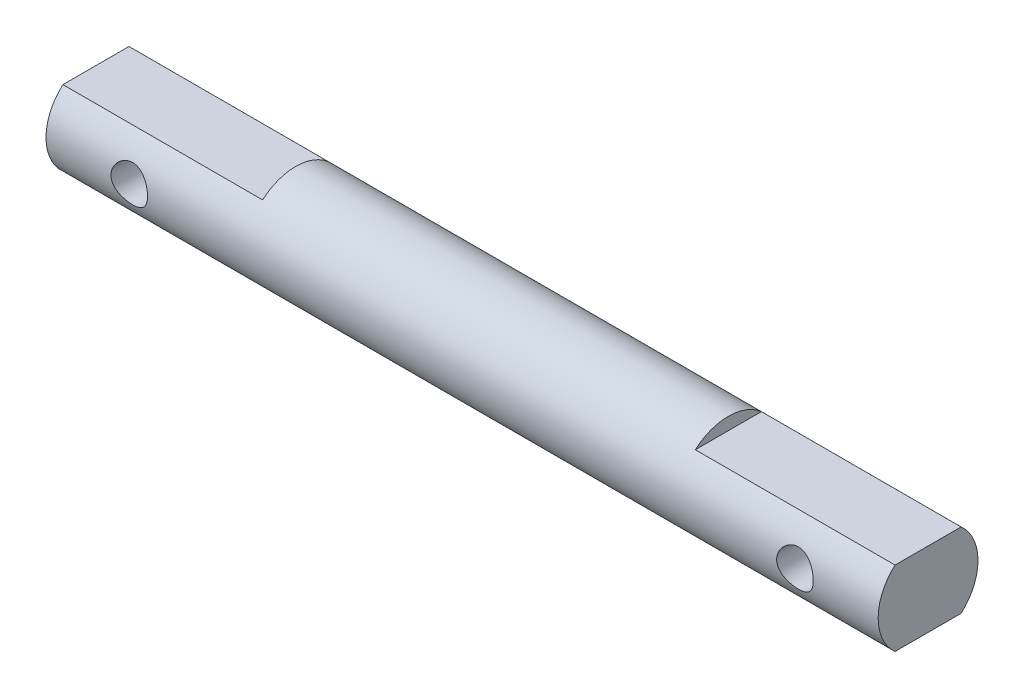
ISO-10303-21;
HEADER;
FILE_DESCRIPTION(('STEP AP214'),'2;1');
FILE_NAME('part.step','',(''),(''),'','','');
FILE_SCHEMA(('AUTOMOTIVE_DESIGN { 1 0 10303 214 1 1 1 1 }'));
ENDSEC;
DATA;
#1=APPLICATION_CONTEXT('core data for automotive mechanical design processes');
#2=APPLICATION_PROTOCOL_DEFINITION('international standard','automotive_design',2000,#1);
#3=PRODUCT_CONTEXT('',#1,'mechanical');
#4=PRODUCT('Part','Part','',(#3));
#5=PRODUCT_RELATED_PRODUCT_CATEGORY('part','',(#4));
#6=PRODUCT_DEFINITION_FORMATION('','',#4);
#7=PRODUCT_DEFINITION_CONTEXT('part definition',#1,'design');
#8=PRODUCT_DEFINITION('design','',#6,#7);
#9=PRODUCT_DEFINITION_SHAPE('','',#8);
#10=(LENGTH_UNIT() NAMED_UNIT(*) SI_UNIT(.MILLI.,.METRE.));
#11=(NAMED_UNIT(*) PLANE_ANGLE_UNIT() SI_UNIT($,.RADIAN.));
#12=(NAMED_UNIT(*) SI_UNIT($,.STERADIAN.) SOLID_ANGLE_UNIT());
#13=UNCERTAINTY_MEASURE_WITH_UNIT(LENGTH_MEASURE(1.E-05),#10,'distance_accuracy_value','');
#14=(GEOMETRIC_REPRESENTATION_CONTEXT(3) GLOBAL_UNCERTAINTY_ASSIGNED_CONTEXT((#13)) GLOBAL_UNIT_ASSIGNED_CONTEXT((#10,
#11,#12)) REPRESENTATION_CONTEXT('',''));
#15=CARTESIAN_POINT('',(0.,0.,0.));
#16=DIRECTION('',(0.,0.,1.));
#17=DIRECTION('',(1.,0.,0.));
#18=AXIS2_PLACEMENT_3D('',#15,#16,#17);
#19=CARTESIAN_POINT('',(-25.,3.,0.));
#20=DIRECTION('',(1.,0.,0.));
#21=DIRECTION('',(0.,0.,-1.));
#22=AXIS2_PLACEMENT_3D('',#19,#20,#21);
#23=PLANE('',#22);
#24=CARTESIAN_POINT('',(-25.,0.,0.));
#25=DIRECTION('',(-1.,0.,0.));
#26=DIRECTION('',(0.,0.,1.));
#27=AXIS2_PLACEMENT_3D('',#24,#25,#26);
#28=CIRCLE('',#27,3.);
#29=CARTESIAN_POINT('',(-25.,2.25,-1.98431348329845));
#30=VERTEX_POINT('',#29);
#31=CARTESIAN_POINT('',(-25.,-2.25,-1.98431348329845));
#32=VERTEX_POINT('',#31);
#33=EDGE_CURVE('E176',#30,#32,#28,.T.);
#34=ORIENTED_EDGE('',*,*,#33,.T.);
#35=DIRECTION('',(0.,0.,1.));
#36=VECTOR('',#35,1.);
#37=CARTESIAN_POINT('',(-25.,-2.25,-3.));
#38=LINE('',#37,#36);
#39=CARTESIAN_POINT('',(-25.,-2.25,1.98431348329845));
#40=VERTEX_POINT('',#39);
#41=EDGE_CURVE('E177',#32,#40,#38,.T.);
#42=ORIENTED_EDGE('',*,*,#41,.T.);
#43=CARTESIAN_POINT('',(-25.,2.25,1.98431348329845));
#44=VERTEX_POINT('',#43);
#45=EDGE_CURVE('E185',#40,#44,#28,.T.);
#46=ORIENTED_EDGE('',*,*,#45,.T.);
#47=DIRECTION('',(0.,0.,1.));
#48=VECTOR('',#47,1.);
#49=CARTESIAN_POINT('',(-25.,2.25,-3.));
#50=LINE('',#49,#48);
#51=EDGE_CURVE('E180',#30,#44,#50,.T.);
#52=ORIENTED_EDGE('',*,*,#51,.F.);
#53=EDGE_LOOP('',(#34,#42,#46,#52));
#54=FACE_BOUND('',#53,.T.);
#55=ADVANCED_FACE('F31',(#54),#23,.F.);
#56=CARTESIAN_POINT('',(25.,3.,0.));
#57=DIRECTION('',(-1.,0.,0.));
#58=DIRECTION('',(0.,0.,1.));
#59=AXIS2_PLACEMENT_3D('',#56,#57,#58);
#60=PLANE('',#59);
#61=CARTESIAN_POINT('',(25.,0.,0.));
#62=DIRECTION('',(-1.,0.,0.));
#63=DIRECTION('',(0.,0.,1.));
#64=AXIS2_PLACEMENT_3D('',#61,#62,#63);
#65=CIRCLE('',#64,3.);
#66=CARTESIAN_POINT('',(25.,-2.25,1.98431348329845));
#67=VERTEX_POINT('',#66);
#68=CARTESIAN_POINT('',(25.,2.25,1.98431348329845));
#69=VERTEX_POINT('',#68);
#70=EDGE_CURVE('E184',#67,#69,#65,.T.);
#71=ORIENTED_EDGE('',*,*,#70,.F.);
#72=DIRECTION('',(0.,0.,1.));
#73=VECTOR('',#72,1.);
#74=CARTESIAN_POINT('',(25.,-2.24999999999999,-3.));
#75=LINE('',#74,#73);
#76=CARTESIAN_POINT('',(25.,-2.24999999999999,-1.98431348329845));
#77=VERTEX_POINT('',#76);
#78=EDGE_CURVE('E49',#77,#67,#75,.T.);
#79=ORIENTED_EDGE('',*,*,#78,.F.);
#80=CARTESIAN_POINT('',(25.,2.25,-1.98431348329845));
#81=VERTEX_POINT('',#80);
#82=EDGE_CURVE('E115',#81,#77,#65,.T.);
#83=ORIENTED_EDGE('',*,*,#82,.F.);
#84=DIRECTION('',(0.,0.,1.));
#85=VECTOR('',#84,1.);
#86=CARTESIAN_POINT('',(25.,2.25,-3.));
#87=LINE('',#86,#85);
#88=EDGE_CURVE('E57',#81,#69,#87,.T.);
#89=ORIENTED_EDGE('',*,*,#88,.T.);
#90=EDGE_LOOP('',(#71,#79,#83,#89));
#91=FACE_BOUND('',#90,.T.);
#92=ADVANCED_FACE('F166',(#91),#60,.F.);
#93=CARTESIAN_POINT('',(0.,0.,0.));
#94=DIRECTION('',(-1.,0.,0.));
#95=DIRECTION('',(0.,0.,1.));
#96=AXIS2_PLACEMENT_3D('',#93,#94,#95);
#97=CYLINDRICAL_SURFACE('',#96,3.);
#98=CARTESIAN_POINT('',(21.1,0.,-3.));
#99=CARTESIAN_POINT('',(21.1000016959377,0.0596653603658475,-3.00000124874777));
#100=CARTESIAN_POINT('',(21.0951301942859,0.119318861047392,-2.99820433362878));
#101=CARTESIAN_POINT('',(21.0758476944229,0.236848244255451,-2.99121508676533));
#102=CARTESIAN_POINT('',(21.0614376008315,0.294724294806991,-2.98602307700504));
#103=CARTESIAN_POINT('',(21.0236525816176,0.406987138550091,-2.97280239953096));
#104=CARTESIAN_POINT('',(21.0002944784406,0.461380257103499,-2.96477905699958));
#105=CARTESIAN_POINT('',(20.9453600789518,0.56547335680578,-2.94669890184719));
#106=CARTESIAN_POINT('',(20.9137816850185,0.615172135653516,-2.93664157034718));
#107=CARTESIAN_POINT('',(20.8419533651427,0.71049716889428,-2.91507648167801));
#108=CARTESIAN_POINT('',(20.8014267972003,0.75590589164363,-2.90352893596448));
#109=CARTESIAN_POINT('',(20.7134398983826,0.839455790057788,-2.88048533673689));
#110=CARTESIAN_POINT('',(20.6659775853424,0.877594880931808,-2.86898929891452));
#111=CARTESIAN_POINT('',(20.563376148578,0.946876023491566,-2.84689276879725));
#112=CARTESIAN_POINT('',(20.5080218172978,0.977715943844814,-2.83633955824423));
#113=CARTESIAN_POINT('',(20.3924637493466,1.02955228614908,-2.81793972857028));
#114=CARTESIAN_POINT('',(20.3322618630331,1.0505524433536,-2.81009208269453));
#115=CARTESIAN_POINT('',(20.2112164474398,1.0812631510737,-2.798415961319));
#116=CARTESIAN_POINT('',(20.1504925023863,1.09138742706648,-2.79444077822037));
#117=CARTESIAN_POINT('',(20.0280875242816,1.10135267987145,-2.7905293041686));
#118=CARTESIAN_POINT('',(19.9664068739079,1.10119766744092,-2.79059143794103));
#119=CARTESIAN_POINT('',(19.8475684309638,1.09092609853663,-2.7946206462547));
#120=CARTESIAN_POINT('',(19.7903527714323,1.08137599754645,-2.79836566494697));
#121=CARTESIAN_POINT('',(19.6784010781988,1.05351920552002,-2.80897082219962));
#122=CARTESIAN_POINT('',(19.6236654025675,1.03521125437041,-2.81583140903281));
#123=CARTESIAN_POINT('',(19.5170456833763,0.990035328733109,-2.8320333504401));
#124=CARTESIAN_POINT('',(19.4652325623985,0.963016175829747,-2.84141799234525));
#125=CARTESIAN_POINT('',(19.3667082597295,0.901290064724288,-2.86159544268106));
#126=CARTESIAN_POINT('',(19.3199987915719,0.866580536276021,-2.87238872140381));
#127=CARTESIAN_POINT('',(19.2298618065168,0.78784062113783,-2.89501075010137));
#128=CARTESIAN_POINT('',(19.1868359200932,0.743355730941567,-2.90686155110834));
#129=CARTESIAN_POINT('',(19.1087384983429,0.647663117597076,-2.92966708861006));
#130=CARTESIAN_POINT('',(19.0736680803958,0.596454451658583,-2.94062169909304));
#131=CARTESIAN_POINT('',(19.0120600315232,0.487779773000808,-2.96060161705553));
#132=CARTESIAN_POINT('',(18.9856506658485,0.430235217521432,-2.96959731294347));
#133=CARTESIAN_POINT('',(18.9430190273705,0.311108672774423,-2.98442731277654));
#134=CARTESIAN_POINT('',(18.9267924370579,0.249528406901531,-2.99026295644358));
#135=CARTESIAN_POINT('',(18.9057463597197,0.127462862761651,-2.99788264484015));
#136=CARTESIAN_POINT('',(18.900385667251,0.0670827891130075,-2.99985872688891));
#137=CARTESIAN_POINT('',(18.8996547992509,-0.0537391869774853,-3.0001264355405));
#138=CARTESIAN_POINT('',(18.9042825233452,-0.114181073749808,-2.99841883675149));
#139=CARTESIAN_POINT('',(18.9229819168092,-0.231108406159618,-2.99163788470485));
#140=CARTESIAN_POINT('',(18.9367037311999,-0.287657784812599,-2.98668929450055));
#141=CARTESIAN_POINT('',(18.9727460210941,-0.397615636671328,-2.97404894323754));
#142=CARTESIAN_POINT('',(18.9950676153823,-0.451023700166589,-2.96635682527047));
#143=CARTESIAN_POINT('',(19.0483784353486,-0.554908427976737,-2.94871738617956));
#144=CARTESIAN_POINT('',(19.0795992520196,-0.605255980194477,-2.93871137811358));
#145=CARTESIAN_POINT('',(19.1495585567129,-0.700162701835578,-2.91755723487566));
#146=CARTESIAN_POINT('',(19.188299730741,-0.744719793590156,-2.90640869230438));
#147=CARTESIAN_POINT('',(19.274729050306,-0.829360890855198,-2.88343377289124));
#148=CARTESIAN_POINT('',(19.322794023905,-0.869060195620299,-2.87160406892303));
#149=CARTESIAN_POINT('',(19.4251419979686,-0.939899669781492,-2.84920568198054));
#150=CARTESIAN_POINT('',(19.4794254299312,-0.971039244708762,-2.83863708661841));
#151=CARTESIAN_POINT('',(19.5930149486137,-1.02386254843665,-2.8200170700311));
#152=CARTESIAN_POINT('',(19.6523338404576,-1.04552125182698,-2.81197232633534));
#153=CARTESIAN_POINT('',(19.7741515392404,-1.07840929932519,-2.79952649364981));
#154=CARTESIAN_POINT('',(19.8366484733941,-1.08964471233036,-2.79512328456104));
#155=CARTESIAN_POINT('',(19.9589005440155,-1.10083806784982,-2.79073255817453));
#156=CARTESIAN_POINT('',(20.0185873167862,-1.1014482886697,-2.79048965654101));
#157=CARTESIAN_POINT('',(20.1371646200869,-1.09303145247646,-2.7937971077441));
#158=CARTESIAN_POINT('',(20.1960552190201,-1.0840052287752,-2.79734713258729));
#159=CARTESIAN_POINT('',(20.3097076343864,-1.05707078841707,-2.80763225279226));
#160=CARTESIAN_POINT('',(20.3645387880301,-1.03941724094369,-2.81427578061567));
#161=CARTESIAN_POINT('',(20.4704956611847,-0.995949426173609,-2.82994981114228));
#162=CARTESIAN_POINT('',(20.5216204604584,-0.970133140652863,-2.83898090407659));
#163=CARTESIAN_POINT('',(20.62153059325,-0.909551414968637,-2.85898260515673));
#164=CARTESIAN_POINT('',(20.6700657713279,-0.874398504847363,-2.87002834990345));
#165=CARTESIAN_POINT('',(20.7607572977932,-0.796752399809455,-2.89254526375225));
#166=CARTESIAN_POINT('',(20.8029116572399,-0.75425692497287,-2.90401656412106));
#167=CARTESIAN_POINT('',(20.8818239918814,-0.660548639786973,-2.92679216754413));
#168=CARTESIAN_POINT('',(20.9181989614741,-0.60900261611206,-2.93805837226636));
#169=CARTESIAN_POINT('',(20.9817509381987,-0.500136860580023,-2.95853467976325));
#170=CARTESIAN_POINT('',(21.00892790779,-0.442817105159341,-2.96774477414609));
#171=CARTESIAN_POINT('',(21.0536679906505,-0.322493606369645,-2.9832468592136));
#172=CARTESIAN_POINT('',(21.0709760902518,-0.259384186418023,-2.9894608548018));
#173=CARTESIAN_POINT('',(21.0941386087502,-0.130844392872352,-2.99783583601898));
#174=CARTESIAN_POINT('',(21.0999981406317,-0.0654150686575991,-2.99999863091548));
#175=CARTESIAN_POINT('',(21.1,0.,-3.));
#176=B_SPLINE_CURVE_WITH_KNOTS('',3,(#98,#99,#100,#101,#102,#103,#104,#105,#106,#107,#108,#109,
#110,#111,#112,#113,#114,#115,#116,#117,#118,#119,#120,#121,#122,#123,#124,#125,#126,#127,#128,
#129,#130,#131,#132,#133,#134,#135,#136,#137,#138,#139,#140,#141,#142,#143,#144,#145,#146,#147,
#148,#149,#150,#151,#152,#153,#154,#155,#156,#157,#158,#159,#160,#161,#162,#163,#164,#165,#166,
#167,#168,#169,#170,#171,#172,#173,#174,#175),.UNSPECIFIED.,.T.,.F.,(4,2,2,2,2,2,2,2,2,2,2,2,2,
2,2,2,2,2,2,2,2,2,2,2,2,2,2,2,2,2,2,2,2,2,2,2,2,2,4),(0.,0.178754907739739,0.357492865169349,
0.535896427659757,0.714345559175,0.899369895863445,1.08444721440599,1.2762026915726,
1.46788531772088,1.65198550181501,1.83601385439912,2.00958682077847,2.18318476902303,
2.35997410918523,2.53682262453215,2.72499447820699,2.91319274508038,3.10406398185192,
3.29485423420864,3.47588192225445,3.65687154732447,3.83127381950643,4.00569878814085,
4.18515848390998,4.36468239466834,4.55415458027959,4.74363992131372,4.93362244947296,
5.12349429191199,5.3016658147168,5.4798219313811,5.65301061537201,5.82624215351945,
6.00825949460879,6.190333455313,6.38165835431487,6.57298403417707,6.76905241099166,
6.96503320271032),.UNSPECIFIED.);
#177=CARTESIAN_POINT('',(21.1,0.,-3.));
#178=VERTEX_POINT('',#177);
#179=EDGE_CURVE('E11',#178,#178,#176,.T.);
#180=ORIENTED_EDGE('',*,*,#179,.T.);
#181=EDGE_LOOP('',(#180));
#182=FACE_BOUND('',#181,.T.);
#183=CARTESIAN_POINT('',(21.1,0.,3.));
#184=CARTESIAN_POINT('',(21.1000016959377,-0.0596653603658475,3.00000124874777));
#185=CARTESIAN_POINT('',(21.0951301942859,-0.119318861047392,2.99820433362878));
#186=CARTESIAN_POINT('',(21.0758476944229,-0.236848244255451,2.99121508676533));
#187=CARTESIAN_POINT('',(21.0614376008315,-0.294724294806991,2.98602307700504));
#188=CARTESIAN_POINT('',(21.0236525816176,-0.406987138550091,2.97280239953096));
#189=CARTESIAN_POINT('',(21.0002944784406,-0.461380257103499,2.96477905699958));
#190=CARTESIAN_POINT('',(20.9453600789518,-0.56547335680578,2.94669890184719));
#191=CARTESIAN_POINT('',(20.9137816850185,-0.615172135653516,2.93664157034718));
#192=CARTESIAN_POINT('',(20.8419533651427,-0.71049716889428,2.91507648167801));
#193=CARTESIAN_POINT('',(20.8014267972003,-0.75590589164363,2.90352893596448));
#194=CARTESIAN_POINT('',(20.7134398983826,-0.839455790057788,2.88048533673689));
#195=CARTESIAN_POINT('',(20.6659775853424,-0.877594880931808,2.86898929891452));
#196=CARTESIAN_POINT('',(20.563376148578,-0.946876023491566,2.84689276879725));
#197=CARTESIAN_POINT('',(20.5080218172978,-0.977715943844814,2.83633955824423));
#198=CARTESIAN_POINT('',(20.3924637493466,-1.02955228614908,2.81793972857028));
#199=CARTESIAN_POINT('',(20.3322618630331,-1.0505524433536,2.81009208269453));
#200=CARTESIAN_POINT('',(20.2112164474398,-1.0812631510737,2.798415961319));
#201=CARTESIAN_POINT('',(20.1504925023863,-1.09138742706648,2.79444077822037));
#202=CARTESIAN_POINT('',(20.0280875242816,-1.10135267987145,2.7905293041686));
#203=CARTESIAN_POINT('',(19.9664068739079,-1.10119766744092,2.79059143794103));
#204=CARTESIAN_POINT('',(19.8475684309638,-1.09092609853663,2.7946206462547));
#205=CARTESIAN_POINT('',(19.7903527714323,-1.08137599754645,2.79836566494697));
#206=CARTESIAN_POINT('',(19.6784010781988,-1.05351920552002,2.80897082219962));
#207=CARTESIAN_POINT('',(19.6236654025675,-1.03521125437041,2.81583140903281));
#208=CARTESIAN_POINT('',(19.5170456833763,-0.990035328733109,2.8320333504401));
#209=CARTESIAN_POINT('',(19.4652325623985,-0.963016175829747,2.84141799234525));
#210=CARTESIAN_POINT('',(19.3667082597295,-0.901290064724288,2.86159544268106));
#211=CARTESIAN_POINT('',(19.3199987915719,-0.866580536276021,2.87238872140381));
#212=CARTESIAN_POINT('',(19.2298618065168,-0.78784062113783,2.89501075010137));
#213=CARTESIAN_POINT('',(19.1868359200932,-0.743355730941567,2.90686155110834));
#214=CARTESIAN_POINT('',(19.1087384983429,-0.647663117597076,2.92966708861006));
#215=CARTESIAN_POINT('',(19.0736680803958,-0.596454451658583,2.94062169909304));
#216=CARTESIAN_POINT('',(19.0120600315232,-0.487779773000808,2.96060161705553));
#217=CARTESIAN_POINT('',(18.9856506658485,-0.430235217521432,2.96959731294347));
#218=CARTESIAN_POINT('',(18.9430190273705,-0.311108672774423,2.98442731277654));
#219=CARTESIAN_POINT('',(18.9267924370579,-0.249528406901531,2.99026295644358));
#220=CARTESIAN_POINT('',(18.9057463597197,-0.127462862761651,2.99788264484015));
#221=CARTESIAN_POINT('',(18.900385667251,-0.0670827891130075,2.99985872688891));
#222=CARTESIAN_POINT('',(18.8996547992509,0.0537391869774853,3.0001264355405));
#223=CARTESIAN_POINT('',(18.9042825233452,0.114181073749808,2.99841883675149));
#224=CARTESIAN_POINT('',(18.9229819168092,0.231108406159618,2.99163788470485));
#225=CARTESIAN_POINT('',(18.9367037311999,0.287657784812599,2.98668929450055));
#226=CARTESIAN_POINT('',(18.9727460210941,0.397615636671328,2.97404894323754));
#227=CARTESIAN_POINT('',(18.9950676153823,0.451023700166589,2.96635682527047));
#228=CARTESIAN_POINT('',(19.0483784353486,0.554908427976737,2.94871738617956));
#229=CARTESIAN_POINT('',(19.0795992520196,0.605255980194477,2.93871137811358));
#230=CARTESIAN_POINT('',(19.1495585567129,0.700162701835578,2.91755723487566));
#231=CARTESIAN_POINT('',(19.188299730741,0.744719793590156,2.90640869230438));
#232=CARTESIAN_POINT('',(19.274729050306,0.829360890855198,2.88343377289124));
#233=CARTESIAN_POINT('',(19.322794023905,0.869060195620299,2.87160406892303));
#234=CARTESIAN_POINT('',(19.4251419979686,0.939899669781492,2.84920568198054));
#235=CARTESIAN_POINT('',(19.4794254299312,0.971039244708762,2.83863708661841));
#236=CARTESIAN_POINT('',(19.5930149486137,1.02386254843665,2.8200170700311));
#237=CARTESIAN_POINT('',(19.6523338404576,1.04552125182698,2.81197232633534));
#238=CARTESIAN_POINT('',(19.7741515392404,1.07840929932519,2.79952649364981));
#239=CARTESIAN_POINT('',(19.8366484733941,1.08964471233036,2.79512328456104));
#240=CARTESIAN_POINT('',(19.9589005440155,1.10083806784982,2.79073255817453));
#241=CARTESIAN_POINT('',(20.0185873167862,1.1014482886697,2.79048965654101));
#242=CARTESIAN_POINT('',(20.1371646200869,1.09303145247646,2.7937971077441));
#243=CARTESIAN_POINT('',(20.1960552190201,1.0840052287752,2.79734713258729));
#244=CARTESIAN_POINT('',(20.3097076343864,1.05707078841707,2.80763225279226));
#245=CARTESIAN_POINT('',(20.3645387880301,1.03941724094369,2.81427578061567));
#246=CARTESIAN_POINT('',(20.4704956611847,0.995949426173609,2.82994981114228));
#247=CARTESIAN_POINT('',(20.5216204604584,0.970133140652863,2.83898090407659));
#248=CARTESIAN_POINT('',(20.62153059325,0.909551414968637,2.85898260515673));
#249=CARTESIAN_POINT('',(20.6700657713279,0.874398504847363,2.87002834990345));
#250=CARTESIAN_POINT('',(20.7607572977932,0.796752399809455,2.89254526375225));
#251=CARTESIAN_POINT('',(20.8029116572399,0.75425692497287,2.90401656412106));
#252=CARTESIAN_POINT('',(20.8818239918814,0.660548639786973,2.92679216754413));
#253=CARTESIAN_POINT('',(20.9181989614741,0.60900261611206,2.93805837226636));
#254=CARTESIAN_POINT('',(20.9817509381987,0.500136860580023,2.95853467976325));
#255=CARTESIAN_POINT('',(21.00892790779,0.442817105159341,2.96774477414609));
#256=CARTESIAN_POINT('',(21.0536679906505,0.322493606369645,2.9832468592136));
#257=CARTESIAN_POINT('',(21.0709760902518,0.259384186418023,2.9894608548018));
#258=CARTESIAN_POINT('',(21.0941386087502,0.130844392872352,2.99783583601898));
#259=CARTESIAN_POINT('',(21.0999981406317,0.0654150686575991,2.99999863091548));
#260=CARTESIAN_POINT('',(21.1,0.,3.));
#261=B_SPLINE_CURVE_WITH_KNOTS('',3,(#183,#184,#185,#186,#187,#188,#189,#190,#191,#192,#193,
#194,#195,#196,#197,#198,#199,#200,#201,#202,#203,#204,#205,#206,#207,#208,#209,#210,#211,#212,
#213,#214,#215,#216,#217,#218,#219,#220,#221,#222,#223,#224,#225,#226,#227,#228,#229,#230,#231,
#232,#233,#234,#235,#236,#237,#238,#239,#240,#241,#242,#243,#244,#245,#246,#247,#248,#249,#250,
#251,#252,#253,#254,#255,#256,#257,#258,#259,#260),.UNSPECIFIED.,.T.,.F.,(4,2,2,2,2,2,2,2,2,2,2,
2,2,2,2,2,2,2,2,2,2,2,2,2,2,2,2,2,2,2,2,2,2,2,2,2,2,2,4),(0.,0.178754907739739,
0.357492865169349,0.535896427659757,0.714345559175,0.899369895863445,1.08444721440599,
1.2762026915726,1.46788531772088,1.65198550181501,1.83601385439912,2.00958682077847,
2.18318476902303,2.35997410918523,2.53682262453215,2.72499447820699,2.91319274508038,
3.10406398185192,3.29485423420864,3.47588192225445,3.65687154732447,3.83127381950643,
4.00569878814085,4.18515848390998,4.36468239466834,4.55415458027959,4.74363992131372,
4.93362244947296,5.12349429191199,5.3016658147168,5.4798219313811,5.65301061537201,
5.82624215351945,6.00825949460879,6.190333455313,6.38165835431487,6.57298403417707,
6.76905241099166,6.96503320271032),.UNSPECIFIED.);
#262=CARTESIAN_POINT('',(21.1,0.,3.));
#263=VERTEX_POINT('',#262);
#264=EDGE_CURVE('E42',#263,#263,#261,.T.);
#265=ORIENTED_EDGE('',*,*,#264,.T.);
#266=EDGE_LOOP('',(#265));
#267=FACE_BOUND('',#266,.T.);
#268=CARTESIAN_POINT('',(-18.9,0.,-3.));
#269=CARTESIAN_POINT('',(-18.8999983040623,0.0596653603658475,-3.00000124874777));
#270=CARTESIAN_POINT('',(-18.9048698057141,0.119318861047392,-2.99820433362878));
#271=CARTESIAN_POINT('',(-18.9241523055771,0.236848244255451,-2.99121508676533));
#272=CARTESIAN_POINT('',(-18.9385623991685,0.294724294806991,-2.98602307700504));
#273=CARTESIAN_POINT('',(-18.9763474183824,0.40698713855009,-2.97280239953096));
#274=CARTESIAN_POINT('',(-18.9997055215594,0.461380257103498,-2.96477905699958));
#275=CARTESIAN_POINT('',(-19.0546399210482,0.56547335680578,-2.94669890184719));
#276=CARTESIAN_POINT('',(-19.0862183149815,0.615172135653516,-2.93664157034718));
#277=CARTESIAN_POINT('',(-19.1580466348573,0.71049716889428,-2.91507648167801));
#278=CARTESIAN_POINT('',(-19.1985732027997,0.755905891643629,-2.90352893596448));
#279=CARTESIAN_POINT('',(-19.2865601016174,0.839455790057788,-2.88048533673689));
#280=CARTESIAN_POINT('',(-19.3340224146576,0.877594880931808,-2.86898929891452));
#281=CARTESIAN_POINT('',(-19.436623851422,0.946876023491566,-2.84689276879725));
#282=CARTESIAN_POINT('',(-19.4919781827022,0.977715943844814,-2.83633955824423));
#283=CARTESIAN_POINT('',(-19.6075362506534,1.02955228614908,-2.81793972857028));
#284=CARTESIAN_POINT('',(-19.6677381369669,1.0505524433536,-2.81009208269453));
#285=CARTESIAN_POINT('',(-19.7887835525602,1.0812631510737,-2.798415961319));
#286=CARTESIAN_POINT('',(-19.8495074976137,1.09138742706648,-2.79444077822037));
#287=CARTESIAN_POINT('',(-19.9719124757184,1.10135267987145,-2.7905293041686));
#288=CARTESIAN_POINT('',(-20.0335931260921,1.10119766744092,-2.79059143794103));
#289=CARTESIAN_POINT('',(-20.1524315690362,1.09092609853663,-2.7946206462547));
#290=CARTESIAN_POINT('',(-20.2096472285677,1.08137599754645,-2.79836566494697));
#291=CARTESIAN_POINT('',(-20.3215989218012,1.05351920552002,-2.80897082219962));
#292=CARTESIAN_POINT('',(-20.3763345974325,1.03521125437041,-2.81583140903281));
#293=CARTESIAN_POINT('',(-20.4829543166237,0.990035328733109,-2.8320333504401));
#294=CARTESIAN_POINT('',(-20.5347674376015,0.963016175829747,-2.84141799234525));
#295=CARTESIAN_POINT('',(-20.6332917402705,0.901290064724288,-2.86159544268106));
#296=CARTESIAN_POINT('',(-20.6800012084281,0.866580536276021,-2.87238872140381));
#297=CARTESIAN_POINT('',(-20.7701381934832,0.78784062113783,-2.89501075010137));
#298=CARTESIAN_POINT('',(-20.8131640799068,0.743355730941567,-2.90686155110834));
#299=CARTESIAN_POINT('',(-20.8912615016571,0.647663117597076,-2.92966708861006));
#300=CARTESIAN_POINT('',(-20.9263319196042,0.596454451658583,-2.94062169909304));
#301=CARTESIAN_POINT('',(-20.9879399684768,0.487779773000808,-2.96060161705553));
#302=CARTESIAN_POINT('',(-21.0143493341515,0.430235217521432,-2.96959731294347));
#303=CARTESIAN_POINT('',(-21.0569809726295,0.311108672774423,-2.98442731277654));
#304=CARTESIAN_POINT('',(-21.0732075629421,0.249528406901531,-2.99026295644358));
#305=CARTESIAN_POINT('',(-21.0942536402803,0.127462862761651,-2.99788264484015));
#306=CARTESIAN_POINT('',(-21.099614332749,0.0670827891130075,-2.99985872688891));
#307=CARTESIAN_POINT('',(-21.1003452007491,-0.0537391869774853,-3.0001264355405));
#308=CARTESIAN_POINT('',(-21.0957174766548,-0.114181073749808,-2.99841883675149));
#309=CARTESIAN_POINT('',(-21.0770180831908,-0.231108406159618,-2.99163788470485));
#310=CARTESIAN_POINT('',(-21.0632962688001,-0.287657784812599,-2.98668929450055));
#311=CARTESIAN_POINT('',(-21.0272539789059,-0.397615636671328,-2.97404894323754));
#312=CARTESIAN_POINT('',(-21.0049323846177,-0.451023700166589,-2.96635682527047));
#313=CARTESIAN_POINT('',(-20.9516215646514,-0.554908427976737,-2.94871738617956));
#314=CARTESIAN_POINT('',(-20.9204007479804,-0.605255980194477,-2.93871137811358));
#315=CARTESIAN_POINT('',(-20.8504414432871,-0.700162701835578,-2.91755723487566));
#316=CARTESIAN_POINT('',(-20.811700269259,-0.744719793590156,-2.90640869230438));
#317=CARTESIAN_POINT('',(-20.725270949694,-0.829360890855198,-2.88343377289124));
#318=CARTESIAN_POINT('',(-20.677205976095,-0.869060195620299,-2.87160406892303));
#319=CARTESIAN_POINT('',(-20.5748580020314,-0.939899669781492,-2.84920568198054));
#320=CARTESIAN_POINT('',(-20.5205745700688,-0.971039244708762,-2.83863708661841));
#321=CARTESIAN_POINT('',(-20.4069850513863,-1.02386254843665,-2.8200170700311));
#322=CARTESIAN_POINT('',(-20.3476661595424,-1.04552125182698,-2.81197232633534));
#323=CARTESIAN_POINT('',(-20.2258484607596,-1.0784092993252,-2.79952649364981));
#324=CARTESIAN_POINT('',(-20.1633515266059,-1.08964471233036,-2.79512328456104));
#325=CARTESIAN_POINT('',(-20.0410994559845,-1.10083806784982,-2.79073255817453));
#326=CARTESIAN_POINT('',(-19.9814126832138,-1.1014482886697,-2.79048965654101));
#327=CARTESIAN_POINT('',(-19.8628353799131,-1.09303145247646,-2.7937971077441));
#328=CARTESIAN_POINT('',(-19.8039447809799,-1.0840052287752,-2.79734713258729));
#329=CARTESIAN_POINT('',(-19.6902923656136,-1.05707078841707,-2.80763225279226));
#330=CARTESIAN_POINT('',(-19.6354612119699,-1.03941724094369,-2.81427578061567));
#331=CARTESIAN_POINT('',(-19.5295043388153,-0.995949426173609,-2.82994981114228));
#332=CARTESIAN_POINT('',(-19.4783795395416,-0.970133140652863,-2.83898090407659));
#333=CARTESIAN_POINT('',(-19.37846940675,-0.909551414968637,-2.85898260515673));
#334=CARTESIAN_POINT('',(-19.3299342286721,-0.874398504847363,-2.87002834990345));
#335=CARTESIAN_POINT('',(-19.2392427022068,-0.796752399809455,-2.89254526375225));
#336=CARTESIAN_POINT('',(-19.1970883427601,-0.75425692497287,-2.90401656412106));
#337=CARTESIAN_POINT('',(-19.1181760081186,-0.660548639786973,-2.92679216754413));
#338=CARTESIAN_POINT('',(-19.0818010385259,-0.60900261611206,-2.93805837226636));
#339=CARTESIAN_POINT('',(-19.0182490618013,-0.500136860580023,-2.95853467976325));
#340=CARTESIAN_POINT('',(-18.99107209221,-0.442817105159341,-2.96774477414609));
#341=CARTESIAN_POINT('',(-18.9463320093495,-0.322493606369645,-2.9832468592136));
#342=CARTESIAN_POINT('',(-18.9290239097482,-0.259384186418022,-2.9894608548018));
#343=CARTESIAN_POINT('',(-18.9058613912498,-0.130844392872352,-2.99783583601898));
#344=CARTESIAN_POINT('',(-18.9000018593683,-0.0654150686575989,-2.99999863091548));
#345=CARTESIAN_POINT('',(-18.9,0.,-3.));
#346=B_SPLINE_CURVE_WITH_KNOTS('',3,(#268,#269,#270,#271,#272,#273,#274,#275,#276,#277,#278,
#279,#280,#281,#282,#283,#284,#285,#286,#287,#288,#289,#290,#291,#292,#293,#294,#295,#296,#297,
#298,#299,#300,#301,#302,#303,#304,#305,#306,#307,#308,#309,#310,#311,#312,#313,#314,#315,#316,
#317,#318,#319,#320,#321,#322,#323,#324,#325,#326,#327,#328,#329,#330,#331,#332,#333,#334,#335,
#336,#337,#338,#339,#340,#341,#342,#343,#344,#345),.UNSPECIFIED.,.T.,.F.,(4,2,2,2,2,2,2,2,2,2,2,
2,2,2,2,2,2,2,2,2,2,2,2,2,2,2,2,2,2,2,2,2,2,2,2,2,2,2,4),(0.,0.178754907739739,
0.357492865169349,0.535896427659754,0.714345559175,0.899369895863445,1.08444721440599,
1.2762026915726,1.46788531772088,1.65198550181501,1.83601385439912,2.00958682077848,
2.18318476902303,2.35997410918523,2.53682262453215,2.72499447820699,2.91319274508038,
3.10406398185192,3.29485423420864,3.47588192225445,3.65687154732447,3.83127381950643,
4.00569878814085,4.18515848390998,4.36468239466834,4.55415458027959,4.74363992131372,
4.93362244947296,5.12349429191199,5.3016658147168,5.4798219313811,5.65301061537201,
5.82624215351945,6.00825949460879,6.190333455313,6.38165835431487,6.57298403417707,
6.76905241099166,6.96503320271032),.UNSPECIFIED.);
#347=CARTESIAN_POINT('',(-18.9,0.,-3.));
#348=VERTEX_POINT('',#347);
#349=EDGE_CURVE('E119',#348,#348,#346,.T.);
#350=ORIENTED_EDGE('',*,*,#349,.T.);
#351=EDGE_LOOP('',(#350));
#352=FACE_BOUND('',#351,.T.);
#353=CARTESIAN_POINT('',(-18.9,0.,3.));
#354=CARTESIAN_POINT('',(-18.8999983040623,-0.0596653603658475,3.00000124874777));
#355=CARTESIAN_POINT('',(-18.9048698057141,-0.119318861047392,2.99820433362878));
#356=CARTESIAN_POINT('',(-18.9241523055771,-0.236848244255451,2.99121508676533));
#357=CARTESIAN_POINT('',(-18.9385623991685,-0.294724294806991,2.98602307700504));
#358=CARTESIAN_POINT('',(-18.9763474183824,-0.40698713855009,2.97280239953096));
#359=CARTESIAN_POINT('',(-18.9997055215594,-0.461380257103498,2.96477905699958));
#360=CARTESIAN_POINT('',(-19.0546399210482,-0.56547335680578,2.94669890184719));
#361=CARTESIAN_POINT('',(-19.0862183149815,-0.615172135653516,2.93664157034718));
#362=CARTESIAN_POINT('',(-19.1580466348573,-0.71049716889428,2.91507648167801));
#363=CARTESIAN_POINT('',(-19.1985732027997,-0.755905891643629,2.90352893596448));
#364=CARTESIAN_POINT('',(-19.2865601016174,-0.839455790057788,2.88048533673689));
#365=CARTESIAN_POINT('',(-19.3340224146576,-0.877594880931808,2.86898929891452));
#366=CARTESIAN_POINT('',(-19.436623851422,-0.946876023491566,2.84689276879725));
#367=CARTESIAN_POINT('',(-19.4919781827022,-0.977715943844814,2.83633955824423));
#368=CARTESIAN_POINT('',(-19.6075362506534,-1.02955228614908,2.81793972857028));
#369=CARTESIAN_POINT('',(-19.6677381369669,-1.0505524433536,2.81009208269453));
#370=CARTESIAN_POINT('',(-19.7887835525602,-1.0812631510737,2.798415961319));
#371=CARTESIAN_POINT('',(-19.8495074976137,-1.09138742706648,2.79444077822037));
#372=CARTESIAN_POINT('',(-19.9719124757184,-1.10135267987145,2.7905293041686));
#373=CARTESIAN_POINT('',(-20.0335931260921,-1.10119766744092,2.79059143794103));
#374=CARTESIAN_POINT('',(-20.1524315690362,-1.09092609853663,2.7946206462547));
#375=CARTESIAN_POINT('',(-20.2096472285677,-1.08137599754645,2.79836566494697));
#376=CARTESIAN_POINT('',(-20.3215989218012,-1.05351920552002,2.80897082219962));
#377=CARTESIAN_POINT('',(-20.3763345974325,-1.03521125437041,2.81583140903281));
#378=CARTESIAN_POINT('',(-20.4829543166237,-0.990035328733109,2.8320333504401));
#379=CARTESIAN_POINT('',(-20.5347674376015,-0.963016175829747,2.84141799234525));
#380=CARTESIAN_POINT('',(-20.6332917402705,-0.901290064724288,2.86159544268106));
#381=CARTESIAN_POINT('',(-20.6800012084281,-0.866580536276021,2.87238872140381));
#382=CARTESIAN_POINT('',(-20.7701381934832,-0.78784062113783,2.89501075010137));
#383=CARTESIAN_POINT('',(-20.8131640799068,-0.743355730941567,2.90686155110834));
#384=CARTESIAN_POINT('',(-20.8912615016571,-0.647663117597076,2.92966708861006));
#385=CARTESIAN_POINT('',(-20.9263319196042,-0.596454451658583,2.94062169909304));
#386=CARTESIAN_POINT('',(-20.9879399684768,-0.487779773000808,2.96060161705553));
#387=CARTESIAN_POINT('',(-21.0143493341515,-0.430235217521432,2.96959731294347));
#388=CARTESIAN_POINT('',(-21.0569809726295,-0.311108672774423,2.98442731277654));
#389=CARTESIAN_POINT('',(-21.0732075629421,-0.249528406901531,2.99026295644358));
#390=CARTESIAN_POINT('',(-21.0942536402803,-0.127462862761651,2.99788264484015));
#391=CARTESIAN_POINT('',(-21.099614332749,-0.0670827891130075,2.99985872688891));
#392=CARTESIAN_POINT('',(-21.1003452007491,0.0537391869774853,3.0001264355405));
#393=CARTESIAN_POINT('',(-21.0957174766548,0.114181073749808,2.99841883675149));
#394=CARTESIAN_POINT('',(-21.0770180831908,0.231108406159618,2.99163788470485));
#395=CARTESIAN_POINT('',(-21.0632962688001,0.287657784812599,2.98668929450055));
#396=CARTESIAN_POINT('',(-21.0272539789059,0.397615636671328,2.97404894323754));
#397=CARTESIAN_POINT('',(-21.0049323846177,0.451023700166589,2.96635682527047));
#398=CARTESIAN_POINT('',(-20.9516215646514,0.554908427976737,2.94871738617956));
#399=CARTESIAN_POINT('',(-20.9204007479804,0.605255980194477,2.93871137811358));
#400=CARTESIAN_POINT('',(-20.8504414432871,0.700162701835578,2.91755723487566));
#401=CARTESIAN_POINT('',(-20.811700269259,0.744719793590156,2.90640869230438));
#402=CARTESIAN_POINT('',(-20.725270949694,0.829360890855198,2.88343377289124));
#403=CARTESIAN_POINT('',(-20.677205976095,0.869060195620299,2.87160406892303));
#404=CARTESIAN_POINT('',(-20.5748580020314,0.939899669781492,2.84920568198054));
#405=CARTESIAN_POINT('',(-20.5205745700688,0.971039244708762,2.83863708661841));
#406=CARTESIAN_POINT('',(-20.4069850513863,1.02386254843665,2.8200170700311));
#407=CARTESIAN_POINT('',(-20.3476661595424,1.04552125182698,2.81197232633534));
#408=CARTESIAN_POINT('',(-20.2258484607596,1.0784092993252,2.79952649364981));
#409=CARTESIAN_POINT('',(-20.1633515266059,1.08964471233036,2.79512328456104));
#410=CARTESIAN_POINT('',(-20.0410994559845,1.10083806784982,2.79073255817453));
#411=CARTESIAN_POINT('',(-19.9814126832138,1.1014482886697,2.79048965654101));
#412=CARTESIAN_POINT('',(-19.8628353799131,1.09303145247646,2.7937971077441));
#413=CARTESIAN_POINT('',(-19.8039447809799,1.0840052287752,2.79734713258729));
#414=CARTESIAN_POINT('',(-19.6902923656136,1.05707078841707,2.80763225279226));
#415=CARTESIAN_POINT('',(-19.6354612119699,1.03941724094369,2.81427578061567));
#416=CARTESIAN_POINT('',(-19.5295043388153,0.995949426173609,2.82994981114228));
#417=CARTESIAN_POINT('',(-19.4783795395416,0.970133140652863,2.83898090407659));
#418=CARTESIAN_POINT('',(-19.37846940675,0.909551414968637,2.85898260515673));
#419=CARTESIAN_POINT('',(-19.3299342286721,0.874398504847363,2.87002834990345));
#420=CARTESIAN_POINT('',(-19.2392427022068,0.796752399809455,2.89254526375225));
#421=CARTESIAN_POINT('',(-19.1970883427601,0.75425692497287,2.90401656412106));
#422=CARTESIAN_POINT('',(-19.1181760081186,0.660548639786973,2.92679216754413));
#423=CARTESIAN_POINT('',(-19.0818010385259,0.60900261611206,2.93805837226636));
#424=CARTESIAN_POINT('',(-19.0182490618013,0.500136860580023,2.95853467976325));
#425=CARTESIAN_POINT('',(-18.99107209221,0.442817105159341,2.96774477414609));
#426=CARTESIAN_POINT('',(-18.9463320093495,0.322493606369645,2.9832468592136));
#427=CARTESIAN_POINT('',(-18.9290239097482,0.259384186418022,2.9894608548018));
#428=CARTESIAN_POINT('',(-18.9058613912498,0.130844392872352,2.99783583601898));
#429=CARTESIAN_POINT('',(-18.9000018593683,0.0654150686575989,2.99999863091548));
#430=CARTESIAN_POINT('',(-18.9,0.,3.));
#431=B_SPLINE_CURVE_WITH_KNOTS('',3,(#353,#354,#355,#356,#357,#358,#359,#360,#361,#362,#363,
#364,#365,#366,#367,#368,#369,#370,#371,#372,#373,#374,#375,#376,#377,#378,#379,#380,#381,#382,
#383,#384,#385,#386,#387,#388,#389,#390,#391,#392,#393,#394,#395,#396,#397,#398,#399,#400,#401,
#402,#403,#404,#405,#406,#407,#408,#409,#410,#411,#412,#413,#414,#415,#416,#417,#418,#419,#420,
#421,#422,#423,#424,#425,#426,#427,#428,#429,#430),.UNSPECIFIED.,.T.,.F.,(4,2,2,2,2,2,2,2,2,2,2,
2,2,2,2,2,2,2,2,2,2,2,2,2,2,2,2,2,2,2,2,2,2,2,2,2,2,2,4),(0.,0.178754907739739,
0.357492865169349,0.535896427659754,0.714345559175,0.899369895863445,1.08444721440599,
1.2762026915726,1.46788531772088,1.65198550181501,1.83601385439912,2.00958682077848,
2.18318476902303,2.35997410918523,2.53682262453215,2.72499447820699,2.91319274508038,
3.10406398185192,3.29485423420864,3.47588192225445,3.65687154732447,3.83127381950643,
4.00569878814085,4.18515848390998,4.36468239466834,4.55415458027959,4.74363992131372,
4.93362244947296,5.12349429191199,5.3016658147168,5.4798219313811,5.65301061537201,
5.82624215351945,6.00825949460879,6.190333455313,6.38165835431487,6.57298403417707,
6.76905241099166,6.96503320271032),.UNSPECIFIED.);
#432=CARTESIAN_POINT('',(-18.9,0.,3.));
#433=VERTEX_POINT('',#432);
#434=EDGE_CURVE('E116',#433,#433,#431,.T.);
#435=ORIENTED_EDGE('',*,*,#434,.T.);
#436=EDGE_LOOP('',(#435));
#437=FACE_BOUND('',#436,.T.);
#438=ORIENTED_EDGE('',*,*,#45,.F.);
#439=DIRECTION('',(-1.,0.,0.));
#440=VECTOR('',#439,1.);
#441=CARTESIAN_POINT('',(0.,-2.25,1.98431348329845));
#442=LINE('',#441,#440);
#443=CARTESIAN_POINT('',(-13.,-2.25,1.98431348329844));
#444=VERTEX_POINT('',#443);
#445=EDGE_CURVE('E204',#40,#444,#442,.F.);
#446=ORIENTED_EDGE('',*,*,#445,.T.);
#447=CARTESIAN_POINT('',(-13.,0.,0.));
#448=DIRECTION('',(1.,0.,0.));
#449=DIRECTION('',(0.,0.,-1.));
#450=AXIS2_PLACEMENT_3D('',#447,#448,#449);
#451=CIRCLE('',#450,3.);
#452=CARTESIAN_POINT('',(-13.,-2.25,-1.98431348329844));
#453=VERTEX_POINT('',#452);
#454=EDGE_CURVE('E199',#444,#453,#451,.T.);
#455=ORIENTED_EDGE('',*,*,#454,.T.);
#456=DIRECTION('',(-1.,0.,0.));
#457=VECTOR('',#456,1.);
#458=CARTESIAN_POINT('',(0.,-2.25,-1.98431348329845));
#459=LINE('',#458,#457);
#460=EDGE_CURVE('E202',#453,#32,#459,.T.);
#461=ORIENTED_EDGE('',*,*,#460,.T.);
#462=ORIENTED_EDGE('',*,*,#33,.F.);
#463=DIRECTION('',(-1.,0.,0.));
#464=VECTOR('',#463,1.);
#465=CARTESIAN_POINT('',(0.,2.25,-1.98431348329845));
#466=LINE('',#465,#464);
#467=CARTESIAN_POINT('',(-13.,2.25,-1.98431348329845));
#468=VERTEX_POINT('',#467);
#469=EDGE_CURVE('E192',#30,#468,#466,.F.);
#470=ORIENTED_EDGE('',*,*,#469,.T.);
#471=CARTESIAN_POINT('',(-13.,0.,0.));
#472=DIRECTION('',(1.,0.,0.));
#473=DIRECTION('',(0.,0.,-1.));
#474=AXIS2_PLACEMENT_3D('',#471,#472,#473);
#475=CIRCLE('',#474,3.);
#476=CARTESIAN_POINT('',(-13.,2.25,1.98431348329845));
#477=VERTEX_POINT('',#476);
#478=EDGE_CURVE('E194',#468,#477,#475,.T.);
#479=ORIENTED_EDGE('',*,*,#478,.T.);
#480=DIRECTION('',(-1.,0.,0.));
#481=VECTOR('',#480,1.);
#482=CARTESIAN_POINT('',(0.,2.25,1.98431348329845));
#483=LINE('',#482,#481);
#484=EDGE_CURVE('E196',#477,#44,#483,.T.);
#485=ORIENTED_EDGE('',*,*,#484,.T.);
#486=EDGE_LOOP('',(#438,#446,#455,#461,#462,#470,#479,#485));
#487=FACE_BOUND('',#486,.T.);
#488=ORIENTED_EDGE('',*,*,#82,.T.);
#489=DIRECTION('',(-1.,0.,0.));
#490=VECTOR('',#489,1.);
#491=CARTESIAN_POINT('',(0.,-2.25,-1.98431348329845));
#492=LINE('',#491,#490);
#493=CARTESIAN_POINT('',(13.,-2.24999999999999,-1.98431348329845));
#494=VERTEX_POINT('',#493);
#495=EDGE_CURVE('E106',#77,#494,#492,.T.);
#496=ORIENTED_EDGE('',*,*,#495,.T.);
#497=CARTESIAN_POINT('',(13.,0.,0.));
#498=DIRECTION('',(-1.,0.,0.));
#499=DIRECTION('',(0.,0.,1.));
#500=AXIS2_PLACEMENT_3D('',#497,#498,#499);
#501=CIRCLE('',#500,3.);
#502=CARTESIAN_POINT('',(13.,-2.24999999999999,1.98431348329845));
#503=VERTEX_POINT('',#502);
#504=EDGE_CURVE('E100',#494,#503,#501,.T.);
#505=ORIENTED_EDGE('',*,*,#504,.T.);
#506=DIRECTION('',(-1.,0.,0.));
#507=VECTOR('',#506,1.);
#508=CARTESIAN_POINT('',(0.,-2.25,1.98431348329845));
#509=LINE('',#508,#507);
#510=EDGE_CURVE('E107',#503,#67,#509,.F.);
#511=ORIENTED_EDGE('',*,*,#510,.T.);
#512=ORIENTED_EDGE('',*,*,#70,.T.);
#513=DIRECTION('',(-1.,0.,0.));
#514=VECTOR('',#513,1.);
#515=CARTESIAN_POINT('',(0.,2.25,1.98431348329845));
#516=LINE('',#515,#514);
#517=CARTESIAN_POINT('',(13.,2.25,1.98431348329845));
#518=VERTEX_POINT('',#517);
#519=EDGE_CURVE('E212',#69,#518,#516,.T.);
#520=ORIENTED_EDGE('',*,*,#519,.T.);
#521=CARTESIAN_POINT('',(13.,0.,0.));
#522=DIRECTION('',(-1.,0.,0.));
#523=DIRECTION('',(0.,0.,1.));
#524=AXIS2_PLACEMENT_3D('',#521,#522,#523);
#525=CIRCLE('',#524,3.);
#526=CARTESIAN_POINT('',(13.,2.25,-1.98431348329845));
#527=VERTEX_POINT('',#526);
#528=EDGE_CURVE('E209',#518,#527,#525,.T.);
#529=ORIENTED_EDGE('',*,*,#528,.T.);
#530=DIRECTION('',(-1.,0.,0.));
#531=VECTOR('',#530,1.);
#532=CARTESIAN_POINT('',(0.,2.25,-1.98431348329845));
#533=LINE('',#532,#531);
#534=EDGE_CURVE('E207',#527,#81,#533,.F.);
#535=ORIENTED_EDGE('',*,*,#534,.T.);
#536=EDGE_LOOP('',(#488,#496,#505,#511,#512,#520,#529,#535));
#537=FACE_BOUND('',#536,.T.);
#538=ADVANCED_FACE('F113',(#182,#267,#352,#437,#487,#537),#97,.T.);
#539=CARTESIAN_POINT('',(-13.,3.,-3.));
#540=DIRECTION('',(1.,0.,0.));
#541=DIRECTION('',(0.,0.,-1.));
#542=AXIS2_PLACEMENT_3D('',#539,#540,#541);
#543=PLANE('',#542);
#544=DIRECTION('',(0.,0.,1.));
#545=VECTOR('',#544,1.);
#546=CARTESIAN_POINT('',(-13.,2.25,-3.));
#547=LINE('',#546,#545);
#548=EDGE_CURVE('E188',#468,#477,#547,.T.);
#549=ORIENTED_EDGE('',*,*,#548,.T.);
#550=ORIENTED_EDGE('',*,*,#478,.F.);
#551=EDGE_LOOP('',(#549,#550));
#552=FACE_BOUND('',#551,.T.);
#553=ADVANCED_FACE('F158',(#552),#543,.F.);
#554=CARTESIAN_POINT('',(-25.,2.25,-3.));
#555=DIRECTION('',(0.,-1.,0.));
#556=DIRECTION('',(1.,0.,0.));
#557=AXIS2_PLACEMENT_3D('',#554,#555,#556);
#558=PLANE('',#557);
#559=ORIENTED_EDGE('',*,*,#548,.F.);
#560=ORIENTED_EDGE('',*,*,#469,.F.);
#561=ORIENTED_EDGE('',*,*,#51,.T.);
#562=ORIENTED_EDGE('',*,*,#484,.F.);
#563=EDGE_LOOP('',(#559,#560,#561,#562));
#564=FACE_BOUND('',#563,.T.);
#565=ADVANCED_FACE('F153',(#564),#558,.F.);
#566=CARTESIAN_POINT('',(-25.,-2.25,-3.));
#567=DIRECTION('',(0.,1.,0.));
#568=DIRECTION('',(-1.,0.,0.));
#569=AXIS2_PLACEMENT_3D('',#566,#567,#568);
#570=PLANE('',#569);
#571=DIRECTION('',(0.,0.,1.));
#572=VECTOR('',#571,1.);
#573=CARTESIAN_POINT('',(-13.,-2.25,-3.));
#574=LINE('',#573,#572);
#575=EDGE_CURVE('E215',#453,#444,#574,.T.);
#576=ORIENTED_EDGE('',*,*,#575,.T.);
#577=ORIENTED_EDGE('',*,*,#445,.F.);
#578=ORIENTED_EDGE('',*,*,#41,.F.);
#579=ORIENTED_EDGE('',*,*,#460,.F.);
#580=EDGE_LOOP('',(#576,#577,#578,#579));
#581=FACE_BOUND('',#580,.T.);
#582=ADVANCED_FACE('F150',(#581),#570,.F.);
#583=CARTESIAN_POINT('',(-13.,-2.25,-3.));
#584=DIRECTION('',(1.,0.,0.));
#585=DIRECTION('',(0.,0.,-1.));
#586=AXIS2_PLACEMENT_3D('',#583,#584,#585);
#587=PLANE('',#586);
#588=ORIENTED_EDGE('',*,*,#575,.F.);
#589=ORIENTED_EDGE('',*,*,#454,.F.);
#590=EDGE_LOOP('',(#588,#589));
#591=FACE_BOUND('',#590,.T.);
#592=ADVANCED_FACE('F148',(#591),#587,.F.);
#593=CARTESIAN_POINT('',(13.,3.,-3.));
#594=DIRECTION('',(-1.,0.,0.));
#595=DIRECTION('',(0.,0.,1.));
#596=AXIS2_PLACEMENT_3D('',#593,#594,#595);
#597=PLANE('',#596);
#598=DIRECTION('',(0.,0.,1.));
#599=VECTOR('',#598,1.);
#600=CARTESIAN_POINT('',(13.,2.25,-3.));
#601=LINE('',#600,#599);
#602=EDGE_CURVE('E110',#527,#518,#601,.T.);
#603=ORIENTED_EDGE('',*,*,#602,.F.);
#604=ORIENTED_EDGE('',*,*,#528,.F.);
#605=EDGE_LOOP('',(#603,#604));
#606=FACE_BOUND('',#605,.T.);
#607=ADVANCED_FACE('F145',(#606),#597,.F.);
#608=CARTESIAN_POINT('',(13.,2.25,-3.));
#609=DIRECTION('',(0.,-1.,0.));
#610=DIRECTION('',(0.,0.,-1.));
#611=AXIS2_PLACEMENT_3D('',#608,#609,#610);
#612=PLANE('',#611);
#613=ORIENTED_EDGE('',*,*,#88,.F.);
#614=ORIENTED_EDGE('',*,*,#534,.F.);
#615=ORIENTED_EDGE('',*,*,#602,.T.);
#616=ORIENTED_EDGE('',*,*,#519,.F.);
#617=EDGE_LOOP('',(#613,#614,#615,#616));
#618=FACE_BOUND('',#617,.T.);
#619=ADVANCED_FACE('F140',(#618),#612,.F.);
#620=CARTESIAN_POINT('',(13.,-2.24999999999999,-3.));
#621=DIRECTION('',(-1.,0.,0.));
#622=DIRECTION('',(0.,0.,1.));
#623=AXIS2_PLACEMENT_3D('',#620,#621,#622);
#624=PLANE('',#623);
#625=DIRECTION('',(0.,0.,1.));
#626=VECTOR('',#625,1.);
#627=CARTESIAN_POINT('',(13.,-2.24999999999999,-3.));
#628=LINE('',#627,#626);
#629=EDGE_CURVE('E103',#494,#503,#628,.T.);
#630=ORIENTED_EDGE('',*,*,#629,.T.);
#631=ORIENTED_EDGE('',*,*,#504,.F.);
#632=EDGE_LOOP('',(#630,#631));
#633=FACE_BOUND('',#632,.T.);
#634=ADVANCED_FACE('F102',(#633),#624,.F.);
#635=CARTESIAN_POINT('',(25.,-2.24999999999999,-3.));
#636=DIRECTION('',(0.,1.,0.));
#637=DIRECTION('',(-1.,0.,0.));
#638=AXIS2_PLACEMENT_3D('',#635,#636,#637);
#639=PLANE('',#638);
#640=ORIENTED_EDGE('',*,*,#78,.T.);
#641=ORIENTED_EDGE('',*,*,#510,.F.);
#642=ORIENTED_EDGE('',*,*,#629,.F.);
#643=ORIENTED_EDGE('',*,*,#495,.F.);
#644=EDGE_LOOP('',(#640,#641,#642,#643));
#645=FACE_BOUND('',#644,.T.);
#646=ADVANCED_FACE('F109',(#645),#639,.F.);
#647=CARTESIAN_POINT('',(-20.,0.,-3.));
#648=DIRECTION('',(0.,0.,1.));
#649=DIRECTION('',(1.,0.,0.));
#650=AXIS2_PLACEMENT_3D('',#647,#648,#649);
#651=CYLINDRICAL_SURFACE('',#650,1.1);
#652=ORIENTED_EDGE('',*,*,#349,.F.);
#653=EDGE_LOOP('',(#652));
#654=FACE_BOUND('',#653,.T.);
#655=ORIENTED_EDGE('',*,*,#434,.F.);
#656=EDGE_LOOP('',(#655));
#657=FACE_BOUND('',#656,.T.);
#658=ADVANCED_FACE('F130',(#654,#657),#651,.F.);
#659=CARTESIAN_POINT('',(20.,0.,-3.));
#660=DIRECTION('',(0.,0.,1.));
#661=DIRECTION('',(1.,0.,0.));
#662=AXIS2_PLACEMENT_3D('',#659,#660,#661);
#663=CYLINDRICAL_SURFACE('',#662,1.1);
#664=ORIENTED_EDGE('',*,*,#179,.F.);
#665=EDGE_LOOP('',(#664));
#666=FACE_BOUND('',#665,.T.);
#667=ORIENTED_EDGE('',*,*,#264,.F.);
#668=EDGE_LOOP('',(#667));
#669=FACE_BOUND('',#668,.T.);
#670=ADVANCED_FACE('F134',(#666,#669),#663,.F.);
#671=CLOSED_SHELL('',(#55,#92,#538,#553,#565,#582,#592,#607,#619,#634,#646,#658,#670));
#672=MANIFOLD_SOLID_BREP('B2',#671);
#673=ADVANCED_BREP_SHAPE_REPRESENTATION('',(#18,#672),#14);
#674=SHAPE_DEFINITION_REPRESENTATION(#9,#673);
ENDSEC;
END-ISO-10303-21;
